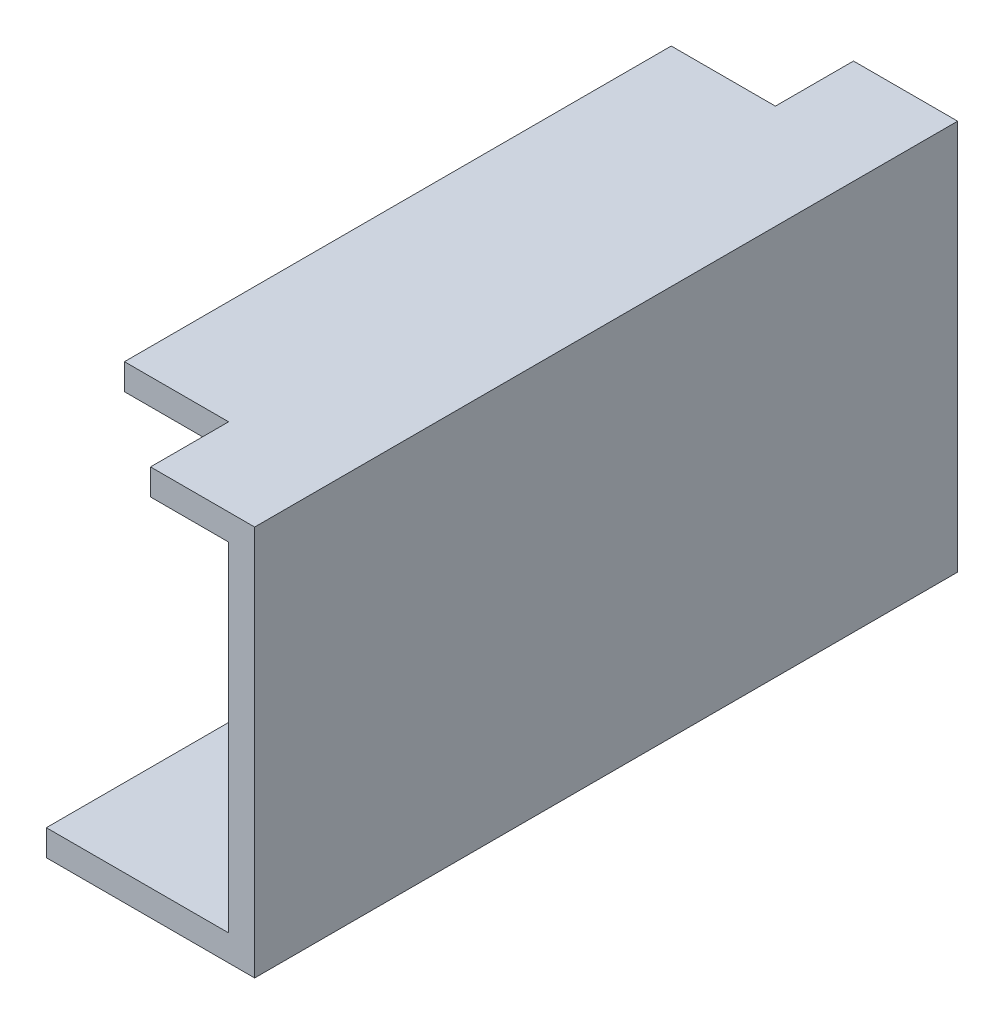
ISO-10303-21;
HEADER;
FILE_DESCRIPTION(('STEP AP214'),'2;1');
FILE_NAME('part.step','',(''),(''),'','','');
FILE_SCHEMA(('AUTOMOTIVE_DESIGN { 1 0 10303 214 1 1 1 1 }'));
ENDSEC;
DATA;
#1=APPLICATION_CONTEXT('core data for automotive mechanical design processes');
#2=APPLICATION_PROTOCOL_DEFINITION('international standard','automotive_design',2000,#1);
#3=PRODUCT_CONTEXT('',#1,'mechanical');
#4=PRODUCT('Part','Part','',(#3));
#5=PRODUCT_RELATED_PRODUCT_CATEGORY('part','',(#4));
#6=PRODUCT_DEFINITION_FORMATION('','',#4);
#7=PRODUCT_DEFINITION_CONTEXT('part definition',#1,'design');
#8=PRODUCT_DEFINITION('design','',#6,#7);
#9=PRODUCT_DEFINITION_SHAPE('','',#8);
#10=(LENGTH_UNIT() NAMED_UNIT(*) SI_UNIT(.MILLI.,.METRE.));
#11=(NAMED_UNIT(*) PLANE_ANGLE_UNIT() SI_UNIT($,.RADIAN.));
#12=(NAMED_UNIT(*) SI_UNIT($,.STERADIAN.) SOLID_ANGLE_UNIT());
#13=UNCERTAINTY_MEASURE_WITH_UNIT(LENGTH_MEASURE(1.E-05),#10,'distance_accuracy_value','');
#14=(GEOMETRIC_REPRESENTATION_CONTEXT(3) GLOBAL_UNCERTAINTY_ASSIGNED_CONTEXT((#13)) GLOBAL_UNIT_ASSIGNED_CONTEXT((#10,
#11,#12)) REPRESENTATION_CONTEXT('',''));
#15=CARTESIAN_POINT('',(0.,0.,0.));
#16=DIRECTION('',(0.,0.,1.));
#17=DIRECTION('',(1.,0.,0.));
#18=AXIS2_PLACEMENT_3D('',#15,#16,#17);
#19=CARTESIAN_POINT('',(1.1,0.0499999999999997,-0.675));
#20=DIRECTION('',(0.,-1.,0.));
#21=DIRECTION('',(0.,0.,-1.));
#22=AXIS2_PLACEMENT_3D('',#19,#20,#21);
#23=PLANE('',#22);
#24=DIRECTION('',(0.,0.,1.));
#25=VECTOR('',#24,1.);
#26=CARTESIAN_POINT('',(0.75,0.0499999999999997,-0.675));
#27=LINE('',#26,#25);
#28=CARTESIAN_POINT('',(0.75,0.0500000000000004,-0.675));
#29=VERTEX_POINT('',#28);
#30=CARTESIAN_POINT('',(0.75,0.0499999999999997,0.675));
#31=VERTEX_POINT('',#30);
#32=EDGE_CURVE('E11',#29,#31,#27,.T.);
#33=ORIENTED_EDGE('',*,*,#32,.T.);
#34=DIRECTION('',(-1.,0.,0.));
#35=VECTOR('',#34,1.);
#36=CARTESIAN_POINT('',(1.1,0.05,0.675));
#37=LINE('',#36,#35);
#38=CARTESIAN_POINT('',(1.1,0.05,0.675));
#39=VERTEX_POINT('',#38);
#40=EDGE_CURVE('E24',#39,#31,#37,.T.);
#41=ORIENTED_EDGE('',*,*,#40,.F.);
#42=DIRECTION('',(0.,0.,-1.));
#43=VECTOR('',#42,1.);
#44=CARTESIAN_POINT('',(1.1,0.0499999999999997,-0.675));
#45=LINE('',#44,#43);
#46=CARTESIAN_POINT('',(1.1,0.0500000000000003,-0.675));
#47=VERTEX_POINT('',#46);
#48=EDGE_CURVE('E196',#39,#47,#45,.T.);
#49=ORIENTED_EDGE('',*,*,#48,.T.);
#50=DIRECTION('',(-1.,0.,0.));
#51=VECTOR('',#50,1.);
#52=CARTESIAN_POINT('',(1.1,0.0500000000000003,-0.675));
#53=LINE('',#52,#51);
#54=EDGE_CURVE('E194',#47,#29,#53,.T.);
#55=ORIENTED_EDGE('',*,*,#54,.T.);
#56=EDGE_LOOP('',(#33,#41,#49,#55));
#57=FACE_BOUND('',#56,.T.);
#58=ADVANCED_FACE('F17',(#57),#23,.F.);
#59=CARTESIAN_POINT('',(1.15,0.,0.675));
#60=DIRECTION('',(0.,1.,0.));
#61=DIRECTION('',(0.,0.,1.));
#62=AXIS2_PLACEMENT_3D('',#59,#60,#61);
#63=PLANE('',#62);
#64=DIRECTION('',(0.,0.,-1.));
#65=VECTOR('',#64,1.);
#66=CARTESIAN_POINT('',(0.75,0.,0.675));
#67=LINE('',#66,#65);
#68=CARTESIAN_POINT('',(0.75,0.,0.675));
#69=VERTEX_POINT('',#68);
#70=CARTESIAN_POINT('',(0.75,0.,-0.675));
#71=VERTEX_POINT('',#70);
#72=EDGE_CURVE('E192',#69,#71,#67,.T.);
#73=ORIENTED_EDGE('',*,*,#72,.T.);
#74=DIRECTION('',(-1.,0.,0.));
#75=VECTOR('',#74,1.);
#76=CARTESIAN_POINT('',(1.15,0.,-0.675));
#77=LINE('',#76,#75);
#78=CARTESIAN_POINT('',(1.15,0.,-0.675));
#79=VERTEX_POINT('',#78);
#80=EDGE_CURVE('E189',#79,#71,#77,.T.);
#81=ORIENTED_EDGE('',*,*,#80,.F.);
#82=DIRECTION('',(0.,0.,1.));
#83=VECTOR('',#82,1.);
#84=CARTESIAN_POINT('',(1.15,0.,0.675));
#85=LINE('',#84,#83);
#86=CARTESIAN_POINT('',(1.15,0.,0.675));
#87=VERTEX_POINT('',#86);
#88=EDGE_CURVE('E187',#79,#87,#85,.T.);
#89=ORIENTED_EDGE('',*,*,#88,.T.);
#90=DIRECTION('',(-1.,0.,0.));
#91=VECTOR('',#90,1.);
#92=CARTESIAN_POINT('',(1.15,0.,0.675));
#93=LINE('',#92,#91);
#94=EDGE_CURVE('E184',#87,#69,#93,.T.);
#95=ORIENTED_EDGE('',*,*,#94,.T.);
#96=EDGE_LOOP('',(#73,#81,#89,#95));
#97=FACE_BOUND('',#96,.T.);
#98=ADVANCED_FACE('F200',(#97),#63,.F.);
#99=CARTESIAN_POINT('',(1.1,0.7,-0.675));
#100=DIRECTION('',(-1.,0.,0.));
#101=DIRECTION('',(0.,0.,-1.));
#102=AXIS2_PLACEMENT_3D('',#99,#100,#101);
#103=PLANE('',#102);
#104=DIRECTION('',(0.,-1.,0.));
#105=VECTOR('',#104,1.);
#106=CARTESIAN_POINT('',(1.1,0.7,0.675));
#107=LINE('',#106,#105);
#108=CARTESIAN_POINT('',(1.1,0.7,0.675));
#109=VERTEX_POINT('',#108);
#110=EDGE_CURVE('E181',#109,#39,#107,.T.);
#111=ORIENTED_EDGE('',*,*,#110,.F.);
#112=DIRECTION('',(0.,0.,1.));
#113=VECTOR('',#112,1.);
#114=CARTESIAN_POINT('',(1.1,0.7,-0.675));
#115=LINE('',#114,#113);
#116=CARTESIAN_POINT('',(1.1,0.7,-0.675));
#117=VERTEX_POINT('',#116);
#118=EDGE_CURVE('E178',#117,#109,#115,.T.);
#119=ORIENTED_EDGE('',*,*,#118,.F.);
#120=DIRECTION('',(0.,-1.,0.));
#121=VECTOR('',#120,1.);
#122=CARTESIAN_POINT('',(1.1,0.7,-0.675));
#123=LINE('',#122,#121);
#124=EDGE_CURVE('E175',#117,#47,#123,.T.);
#125=ORIENTED_EDGE('',*,*,#124,.T.);
#126=ORIENTED_EDGE('',*,*,#48,.F.);
#127=EDGE_LOOP('',(#111,#119,#125,#126));
#128=FACE_BOUND('',#127,.T.);
#129=ADVANCED_FACE('F233',(#128),#103,.T.);
#130=CARTESIAN_POINT('',(1.15,0.75,0.675));
#131=DIRECTION('',(1.,0.,0.));
#132=DIRECTION('',(0.,0.,1.));
#133=AXIS2_PLACEMENT_3D('',#130,#131,#132);
#134=PLANE('',#133);
#135=DIRECTION('',(0.,-1.,0.));
#136=VECTOR('',#135,1.);
#137=CARTESIAN_POINT('',(1.15,0.75,-0.675));
#138=LINE('',#137,#136);
#139=CARTESIAN_POINT('',(1.15,0.75,-0.675));
#140=VERTEX_POINT('',#139);
#141=EDGE_CURVE('E172',#140,#79,#138,.T.);
#142=ORIENTED_EDGE('',*,*,#141,.F.);
#143=DIRECTION('',(0.,0.,-1.));
#144=VECTOR('',#143,1.);
#145=CARTESIAN_POINT('',(1.15,0.75,0.675));
#146=LINE('',#145,#144);
#147=CARTESIAN_POINT('',(1.15,0.750000000000001,0.675));
#148=VERTEX_POINT('',#147);
#149=EDGE_CURVE('E170',#148,#140,#146,.T.);
#150=ORIENTED_EDGE('',*,*,#149,.F.);
#151=DIRECTION('',(0.,-1.,0.));
#152=VECTOR('',#151,1.);
#153=CARTESIAN_POINT('',(1.15,0.750000000000001,0.675));
#154=LINE('',#153,#152);
#155=EDGE_CURVE('E122',#148,#87,#154,.T.);
#156=ORIENTED_EDGE('',*,*,#155,.T.);
#157=ORIENTED_EDGE('',*,*,#88,.F.);
#158=EDGE_LOOP('',(#142,#150,#156,#157));
#159=FACE_BOUND('',#158,.T.);
#160=ADVANCED_FACE('F203',(#159),#134,.T.);
#161=CARTESIAN_POINT('',(2.47592560861063,0.700000000000001,-0.675));
#162=DIRECTION('',(0.,1.,0.));
#163=DIRECTION('',(1.,0.,0.));
#164=AXIS2_PLACEMENT_3D('',#161,#162,#163);
#165=PLANE('',#164);
#166=DIRECTION('',(0.,0.,1.));
#167=VECTOR('',#166,1.);
#168=CARTESIAN_POINT('',(0.75,0.7,-0.675));
#169=LINE('',#168,#167);
#170=CARTESIAN_POINT('',(0.75,0.7,-0.525));
#171=VERTEX_POINT('',#170);
#172=CARTESIAN_POINT('',(0.750000000000001,0.7,0.525));
#173=VERTEX_POINT('',#172);
#174=EDGE_CURVE('E167',#171,#173,#169,.T.);
#175=ORIENTED_EDGE('',*,*,#174,.F.);
#176=DIRECTION('',(-1.,0.,0.));
#177=VECTOR('',#176,1.);
#178=CARTESIAN_POINT('',(0.75,0.7,-0.525));
#179=LINE('',#178,#177);
#180=CARTESIAN_POINT('',(0.950000000000001,0.7,-0.525));
#181=VERTEX_POINT('',#180);
#182=EDGE_CURVE('E164',#181,#171,#179,.T.);
#183=ORIENTED_EDGE('',*,*,#182,.F.);
#184=DIRECTION('',(0.,0.,1.));
#185=VECTOR('',#184,1.);
#186=CARTESIAN_POINT('',(0.950000000000001,0.7,-0.675));
#187=LINE('',#186,#185);
#188=CARTESIAN_POINT('',(0.950000000000001,0.7,-0.675));
#189=VERTEX_POINT('',#188);
#190=EDGE_CURVE('E161',#189,#181,#187,.T.);
#191=ORIENTED_EDGE('',*,*,#190,.F.);
#192=DIRECTION('',(-1.,0.,0.));
#193=VECTOR('',#192,1.);
#194=CARTESIAN_POINT('',(2.47592560861063,0.700000000000001,-0.675));
#195=LINE('',#194,#193);
#196=EDGE_CURVE('E158',#117,#189,#195,.T.);
#197=ORIENTED_EDGE('',*,*,#196,.F.);
#198=ORIENTED_EDGE('',*,*,#118,.T.);
#199=DIRECTION('',(-1.,0.,0.));
#200=VECTOR('',#199,1.);
#201=CARTESIAN_POINT('',(2.47592560861063,0.700000000000001,0.675));
#202=LINE('',#201,#200);
#203=CARTESIAN_POINT('',(0.950000000000001,0.7,0.675));
#204=VERTEX_POINT('',#203);
#205=EDGE_CURVE('E156',#109,#204,#202,.T.);
#206=ORIENTED_EDGE('',*,*,#205,.T.);
#207=DIRECTION('',(0.,0.,1.));
#208=VECTOR('',#207,1.);
#209=CARTESIAN_POINT('',(0.950000000000001,0.7,0.675));
#210=LINE('',#209,#208);
#211=CARTESIAN_POINT('',(0.950000000000001,0.7,0.525));
#212=VERTEX_POINT('',#211);
#213=EDGE_CURVE('E126',#212,#204,#210,.T.);
#214=ORIENTED_EDGE('',*,*,#213,.F.);
#215=DIRECTION('',(1.,0.,0.));
#216=VECTOR('',#215,1.);
#217=CARTESIAN_POINT('',(0.75,0.7,0.525));
#218=LINE('',#217,#216);
#219=EDGE_CURVE('E152',#173,#212,#218,.T.);
#220=ORIENTED_EDGE('',*,*,#219,.F.);
#221=EDGE_LOOP('',(#175,#183,#191,#197,#198,#206,#214,#220));
#222=FACE_BOUND('',#221,.T.);
#223=ADVANCED_FACE('F231',(#222),#165,.F.);
#224=CARTESIAN_POINT('',(2.47592560861063,0.750000000000001,-0.675));
#225=DIRECTION('',(0.,0.,1.));
#226=DIRECTION('',(-1.,0.,0.));
#227=AXIS2_PLACEMENT_3D('',#224,#225,#226);
#228=PLANE('',#227);
#229=ORIENTED_EDGE('',*,*,#196,.T.);
#230=DIRECTION('',(0.,1.,0.));
#231=VECTOR('',#230,1.);
#232=CARTESIAN_POINT('',(0.950000000000001,-0.001000000000001,-0.675));
#233=LINE('',#232,#231);
#234=CARTESIAN_POINT('',(0.950000000000001,0.749999999999999,-0.675));
#235=VERTEX_POINT('',#234);
#236=EDGE_CURVE('E150',#189,#235,#233,.T.);
#237=ORIENTED_EDGE('',*,*,#236,.T.);
#238=DIRECTION('',(-1.,0.,0.));
#239=VECTOR('',#238,1.);
#240=CARTESIAN_POINT('',(2.47592560861063,0.750000000000001,-0.675));
#241=LINE('',#240,#239);
#242=EDGE_CURVE('E147',#140,#235,#241,.T.);
#243=ORIENTED_EDGE('',*,*,#242,.F.);
#244=ORIENTED_EDGE('',*,*,#141,.T.);
#245=ORIENTED_EDGE('',*,*,#80,.T.);
#246=DIRECTION('',(0.,1.,0.));
#247=VECTOR('',#246,1.);
#248=CARTESIAN_POINT('',(0.75,0.375,-0.675));
#249=LINE('',#248,#247);
#250=EDGE_CURVE('E144',#71,#29,#249,.T.);
#251=ORIENTED_EDGE('',*,*,#250,.T.);
#252=ORIENTED_EDGE('',*,*,#54,.F.);
#253=ORIENTED_EDGE('',*,*,#124,.F.);
#254=EDGE_LOOP('',(#229,#237,#243,#244,#245,#251,#252,#253));
#255=FACE_BOUND('',#254,.T.);
#256=ADVANCED_FACE('F206',(#255),#228,.F.);
#257=CARTESIAN_POINT('',(2.47592560861063,0.750000000000001,0.675));
#258=DIRECTION('',(0.,-1.,0.));
#259=DIRECTION('',(-1.,0.,0.));
#260=AXIS2_PLACEMENT_3D('',#257,#258,#259);
#261=PLANE('',#260);
#262=DIRECTION('',(0.,0.,-1.));
#263=VECTOR('',#262,1.);
#264=CARTESIAN_POINT('',(0.950000000000001,0.749999999999999,-0.675));
#265=LINE('',#264,#263);
#266=CARTESIAN_POINT('',(0.950000000000001,0.749999999999999,-0.525));
#267=VERTEX_POINT('',#266);
#268=EDGE_CURVE('E141',#267,#235,#265,.T.);
#269=ORIENTED_EDGE('',*,*,#268,.F.);
#270=DIRECTION('',(1.,0.,0.));
#271=VECTOR('',#270,1.);
#272=CARTESIAN_POINT('',(0.750000000000001,0.749999999999999,-0.525));
#273=LINE('',#272,#271);
#274=CARTESIAN_POINT('',(0.750000000000001,0.749999999999999,-0.525));
#275=VERTEX_POINT('',#274);
#276=EDGE_CURVE('E138',#275,#267,#273,.T.);
#277=ORIENTED_EDGE('',*,*,#276,.F.);
#278=DIRECTION('',(0.,0.,-1.));
#279=VECTOR('',#278,1.);
#280=CARTESIAN_POINT('',(0.75,0.75,0.675));
#281=LINE('',#280,#279);
#282=CARTESIAN_POINT('',(0.75,0.75,0.525));
#283=VERTEX_POINT('',#282);
#284=EDGE_CURVE('E135',#283,#275,#281,.T.);
#285=ORIENTED_EDGE('',*,*,#284,.F.);
#286=DIRECTION('',(-1.,0.,0.));
#287=VECTOR('',#286,1.);
#288=CARTESIAN_POINT('',(0.750000000000001,0.749999999999999,0.525));
#289=LINE('',#288,#287);
#290=CARTESIAN_POINT('',(0.950000000000001,0.749999999999999,0.525));
#291=VERTEX_POINT('',#290);
#292=EDGE_CURVE('E108',#291,#283,#289,.T.);
#293=ORIENTED_EDGE('',*,*,#292,.F.);
#294=DIRECTION('',(0.,0.,-1.));
#295=VECTOR('',#294,1.);
#296=CARTESIAN_POINT('',(0.950000000000001,0.749999999999999,0.675));
#297=LINE('',#296,#295);
#298=CARTESIAN_POINT('',(0.950000000000001,0.749999999999999,0.675));
#299=VERTEX_POINT('',#298);
#300=EDGE_CURVE('E102',#299,#291,#297,.T.);
#301=ORIENTED_EDGE('',*,*,#300,.F.);
#302=DIRECTION('',(-1.,0.,0.));
#303=VECTOR('',#302,1.);
#304=CARTESIAN_POINT('',(2.47592560861063,0.750000000000001,0.675));
#305=LINE('',#304,#303);
#306=EDGE_CURVE('E106',#148,#299,#305,.T.);
#307=ORIENTED_EDGE('',*,*,#306,.F.);
#308=ORIENTED_EDGE('',*,*,#149,.T.);
#309=ORIENTED_EDGE('',*,*,#242,.T.);
#310=EDGE_LOOP('',(#269,#277,#285,#293,#301,#307,#308,#309));
#311=FACE_BOUND('',#310,.T.);
#312=ADVANCED_FACE('F104',(#311),#261,.F.);
#313=CARTESIAN_POINT('',(2.47592560861063,0.700000000000001,0.675));
#314=DIRECTION('',(0.,0.,-1.));
#315=DIRECTION('',(0.,1.,0.));
#316=AXIS2_PLACEMENT_3D('',#313,#314,#315);
#317=PLANE('',#316);
#318=ORIENTED_EDGE('',*,*,#306,.T.);
#319=DIRECTION('',(0.,1.,0.));
#320=VECTOR('',#319,1.);
#321=CARTESIAN_POINT('',(0.950000000000001,-0.001000000000001,0.675));
#322=LINE('',#321,#320);
#323=EDGE_CURVE('E119',#204,#299,#322,.T.);
#324=ORIENTED_EDGE('',*,*,#323,.F.);
#325=ORIENTED_EDGE('',*,*,#205,.F.);
#326=ORIENTED_EDGE('',*,*,#110,.T.);
#327=ORIENTED_EDGE('',*,*,#40,.T.);
#328=DIRECTION('',(0.,-1.,0.));
#329=VECTOR('',#328,1.);
#330=CARTESIAN_POINT('',(0.75,0.375,0.675000000000001));
#331=LINE('',#330,#329);
#332=EDGE_CURVE('E127',#31,#69,#331,.T.);
#333=ORIENTED_EDGE('',*,*,#332,.T.);
#334=ORIENTED_EDGE('',*,*,#94,.F.);
#335=ORIENTED_EDGE('',*,*,#155,.F.);
#336=EDGE_LOOP('',(#318,#324,#325,#326,#327,#333,#334,#335));
#337=FACE_BOUND('',#336,.T.);
#338=ADVANCED_FACE('F117',(#337),#317,.F.);
#339=CARTESIAN_POINT('',(0.75,0.75,0.675));
#340=DIRECTION('',(1.,0.,0.));
#341=DIRECTION('',(0.,0.,1.));
#342=AXIS2_PLACEMENT_3D('',#339,#340,#341);
#343=PLANE('',#342);
#344=ORIENTED_EDGE('',*,*,#284,.T.);
#345=DIRECTION('',(0.,1.,0.));
#346=VECTOR('',#345,1.);
#347=CARTESIAN_POINT('',(0.750000000000001,-0.001000000000001,-0.525));
#348=LINE('',#347,#346);
#349=EDGE_CURVE('E130',#171,#275,#348,.T.);
#350=ORIENTED_EDGE('',*,*,#349,.F.);
#351=ORIENTED_EDGE('',*,*,#174,.T.);
#352=DIRECTION('',(0.,1.,0.));
#353=VECTOR('',#352,1.);
#354=CARTESIAN_POINT('',(0.750000000000001,-0.001000000000001,0.525));
#355=LINE('',#354,#353);
#356=EDGE_CURVE('E220',#173,#283,#355,.T.);
#357=ORIENTED_EDGE('',*,*,#356,.T.);
#358=EDGE_LOOP('',(#344,#350,#351,#357));
#359=FACE_BOUND('',#358,.T.);
#360=ADVANCED_FACE('F255',(#359),#343,.F.);
#361=CARTESIAN_POINT('',(0.75,0.0249999999999999,0.));
#362=DIRECTION('',(-1.,0.,0.));
#363=DIRECTION('',(0.,0.,-1.));
#364=AXIS2_PLACEMENT_3D('',#361,#362,#363);
#365=PLANE('',#364);
#366=ORIENTED_EDGE('',*,*,#332,.F.);
#367=ORIENTED_EDGE('',*,*,#32,.F.);
#368=ORIENTED_EDGE('',*,*,#250,.F.);
#369=ORIENTED_EDGE('',*,*,#72,.F.);
#370=EDGE_LOOP('',(#366,#367,#368,#369));
#371=FACE_BOUND('',#370,.T.);
#372=ADVANCED_FACE('F198',(#371),#365,.T.);
#373=CARTESIAN_POINT('',(0.950000000000001,-0.001000000000001,0.675));
#374=DIRECTION('',(1.,0.,0.));
#375=DIRECTION('',(0.,1.,0.));
#376=AXIS2_PLACEMENT_3D('',#373,#374,#375);
#377=PLANE('',#376);
#378=ORIENTED_EDGE('',*,*,#213,.T.);
#379=ORIENTED_EDGE('',*,*,#323,.T.);
#380=ORIENTED_EDGE('',*,*,#300,.T.);
#381=DIRECTION('',(0.,1.,0.));
#382=VECTOR('',#381,1.);
#383=CARTESIAN_POINT('',(0.950000000000001,-0.001000000000001,0.525));
#384=LINE('',#383,#382);
#385=EDGE_CURVE('E222',#212,#291,#384,.T.);
#386=ORIENTED_EDGE('',*,*,#385,.F.);
#387=EDGE_LOOP('',(#378,#379,#380,#386));
#388=FACE_BOUND('',#387,.T.);
#389=ADVANCED_FACE('F125',(#388),#377,.F.);
#390=CARTESIAN_POINT('',(0.750000000000001,-0.001000000000001,0.525));
#391=DIRECTION('',(0.,0.,-1.));
#392=DIRECTION('',(0.,1.,0.));
#393=AXIS2_PLACEMENT_3D('',#390,#391,#392);
#394=PLANE('',#393);
#395=ORIENTED_EDGE('',*,*,#219,.T.);
#396=ORIENTED_EDGE('',*,*,#385,.T.);
#397=ORIENTED_EDGE('',*,*,#292,.T.);
#398=ORIENTED_EDGE('',*,*,#356,.F.);
#399=EDGE_LOOP('',(#395,#396,#397,#398));
#400=FACE_BOUND('',#399,.T.);
#401=ADVANCED_FACE('F227',(#400),#394,.F.);
#402=CARTESIAN_POINT('',(0.750000000000001,-0.001000000000001,-0.525));
#403=DIRECTION('',(0.,0.,1.));
#404=DIRECTION('',(0.,-1.,0.));
#405=AXIS2_PLACEMENT_3D('',#402,#403,#404);
#406=PLANE('',#405);
#407=ORIENTED_EDGE('',*,*,#182,.T.);
#408=ORIENTED_EDGE('',*,*,#349,.T.);
#409=ORIENTED_EDGE('',*,*,#276,.T.);
#410=DIRECTION('',(0.,1.,0.));
#411=VECTOR('',#410,1.);
#412=CARTESIAN_POINT('',(0.950000000000001,-0.001000000000001,-0.525));
#413=LINE('',#412,#411);
#414=EDGE_CURVE('E214',#181,#267,#413,.T.);
#415=ORIENTED_EDGE('',*,*,#414,.F.);
#416=EDGE_LOOP('',(#407,#408,#409,#415));
#417=FACE_BOUND('',#416,.T.);
#418=ADVANCED_FACE('F217',(#417),#406,.F.);
#419=CARTESIAN_POINT('',(0.950000000000001,-0.001000000000001,-0.675));
#420=DIRECTION('',(1.,0.,0.));
#421=DIRECTION('',(0.,1.,0.));
#422=AXIS2_PLACEMENT_3D('',#419,#420,#421);
#423=PLANE('',#422);
#424=ORIENTED_EDGE('',*,*,#190,.T.);
#425=ORIENTED_EDGE('',*,*,#414,.T.);
#426=ORIENTED_EDGE('',*,*,#268,.T.);
#427=ORIENTED_EDGE('',*,*,#236,.F.);
#428=EDGE_LOOP('',(#424,#425,#426,#427));
#429=FACE_BOUND('',#428,.T.);
#430=ADVANCED_FACE('F211',(#429),#423,.F.);
#431=CLOSED_SHELL('',(#58,#98,#129,#160,#223,#256,#312,#338,#360,#372,#389,#401,#418,#430));
#432=MANIFOLD_SOLID_BREP('B1',#431);
#433=ADVANCED_BREP_SHAPE_REPRESENTATION('',(#18,#432),#14);
#434=SHAPE_DEFINITION_REPRESENTATION(#9,#433);
ENDSEC;
END-ISO-10303-21;
